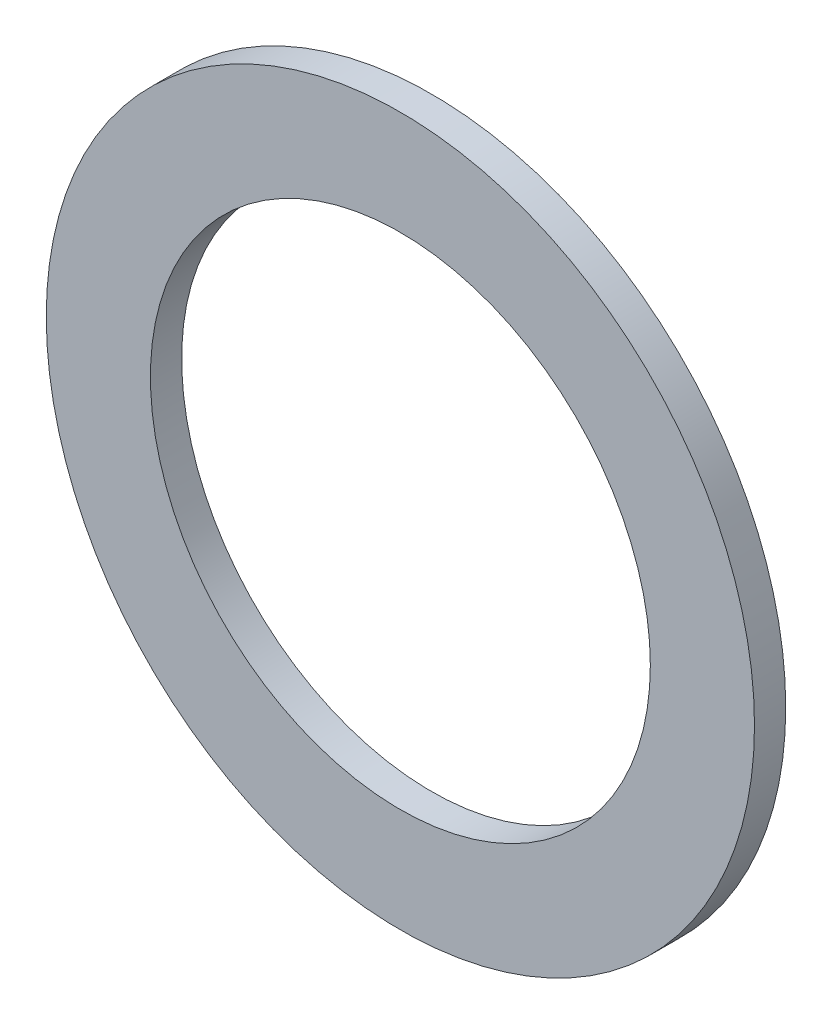
ISO-10303-21;
HEADER;
FILE_DESCRIPTION(('STEP AP214'),'2;1');
FILE_NAME('part.step','',(''),(''),'','','');
FILE_SCHEMA(('AUTOMOTIVE_DESIGN { 1 0 10303 214 1 1 1 1 }'));
ENDSEC;
DATA;
#1=APPLICATION_CONTEXT('core data for automotive mechanical design processes');
#2=APPLICATION_PROTOCOL_DEFINITION('international standard','automotive_design',2000,#1);
#3=PRODUCT_CONTEXT('',#1,'mechanical');
#4=PRODUCT('Part','Part','',(#3));
#5=PRODUCT_RELATED_PRODUCT_CATEGORY('part','',(#4));
#6=PRODUCT_DEFINITION_FORMATION('','',#4);
#7=PRODUCT_DEFINITION_CONTEXT('part definition',#1,'design');
#8=PRODUCT_DEFINITION('design','',#6,#7);
#9=PRODUCT_DEFINITION_SHAPE('','',#8);
#10=(LENGTH_UNIT() NAMED_UNIT(*) SI_UNIT(.MILLI.,.METRE.));
#11=(NAMED_UNIT(*) PLANE_ANGLE_UNIT() SI_UNIT($,.RADIAN.));
#12=(NAMED_UNIT(*) SI_UNIT($,.STERADIAN.) SOLID_ANGLE_UNIT());
#13=UNCERTAINTY_MEASURE_WITH_UNIT(LENGTH_MEASURE(1.E-05),#10,'distance_accuracy_value','');
#14=(GEOMETRIC_REPRESENTATION_CONTEXT(3) GLOBAL_UNCERTAINTY_ASSIGNED_CONTEXT((#13)) GLOBAL_UNIT_ASSIGNED_CONTEXT((#10,
#11,#12)) REPRESENTATION_CONTEXT('',''));
#15=CARTESIAN_POINT('',(0.,0.,0.));
#16=DIRECTION('',(0.,0.,1.));
#17=DIRECTION('',(1.,0.,0.));
#18=AXIS2_PLACEMENT_3D('',#15,#16,#17);
#19=CARTESIAN_POINT('',(0.,0.,1.5));
#20=DIRECTION('',(0.,0.,1.));
#21=DIRECTION('',(1.,0.,0.));
#22=AXIS2_PLACEMENT_3D('',#19,#20,#21);
#23=PLANE('',#22);
#24=CARTESIAN_POINT('',(0.,0.,1.5));
#25=DIRECTION('',(0.,0.,1.));
#26=DIRECTION('',(1.,0.,0.));
#27=AXIS2_PLACEMENT_3D('',#24,#25,#26);
#28=CIRCLE('',#27,17.);
#29=CARTESIAN_POINT('',(17.,0.,1.5));
#30=VERTEX_POINT('',#29);
#31=EDGE_CURVE('E11',#30,#30,#28,.T.);
#32=ORIENTED_EDGE('',*,*,#31,.T.);
#33=EDGE_LOOP('',(#32));
#34=FACE_BOUND('',#33,.T.);
#35=CARTESIAN_POINT('',(0.,0.,1.5));
#36=DIRECTION('',(0.,0.,1.));
#37=DIRECTION('',(1.,0.,0.));
#38=AXIS2_PLACEMENT_3D('',#35,#36,#37);
#39=CIRCLE('',#38,12.);
#40=CARTESIAN_POINT('',(12.,0.,1.5));
#41=VERTEX_POINT('',#40);
#42=EDGE_CURVE('E47',#41,#41,#39,.T.);
#43=ORIENTED_EDGE('',*,*,#42,.F.);
#44=EDGE_LOOP('',(#43));
#45=FACE_BOUND('',#44,.T.);
#46=ADVANCED_FACE('F36',(#34,#45),#23,.T.);
#47=CARTESIAN_POINT('',(0.,0.,0.));
#48=DIRECTION('',(0.,0.,1.));
#49=DIRECTION('',(1.,0.,0.));
#50=AXIS2_PLACEMENT_3D('',#47,#48,#49);
#51=PLANE('',#50);
#52=CARTESIAN_POINT('',(0.,0.,0.));
#53=DIRECTION('',(0.,0.,1.));
#54=DIRECTION('',(1.,0.,0.));
#55=AXIS2_PLACEMENT_3D('',#52,#53,#54);
#56=CIRCLE('',#55,17.);
#57=CARTESIAN_POINT('',(17.,0.,0.));
#58=VERTEX_POINT('',#57);
#59=EDGE_CURVE('E40',#58,#58,#56,.T.);
#60=ORIENTED_EDGE('',*,*,#59,.F.);
#61=EDGE_LOOP('',(#60));
#62=FACE_BOUND('',#61,.T.);
#63=CARTESIAN_POINT('',(0.,0.,0.));
#64=DIRECTION('',(0.,0.,1.));
#65=DIRECTION('',(1.,0.,0.));
#66=AXIS2_PLACEMENT_3D('',#63,#64,#65);
#67=CIRCLE('',#66,12.);
#68=CARTESIAN_POINT('',(12.,0.,0.));
#69=VERTEX_POINT('',#68);
#70=EDGE_CURVE('E49',#69,#69,#67,.T.);
#71=ORIENTED_EDGE('',*,*,#70,.T.);
#72=EDGE_LOOP('',(#71));
#73=FACE_BOUND('',#72,.T.);
#74=ADVANCED_FACE('F59',(#62,#73),#51,.F.);
#75=CARTESIAN_POINT('',(0.,0.,1.5));
#76=DIRECTION('',(0.,0.,-1.));
#77=DIRECTION('',(-1.,0.,0.));
#78=AXIS2_PLACEMENT_3D('',#75,#76,#77);
#79=CYLINDRICAL_SURFACE('',#78,17.);
#80=ORIENTED_EDGE('',*,*,#31,.F.);
#81=EDGE_LOOP('',(#80));
#82=FACE_BOUND('',#81,.T.);
#83=ORIENTED_EDGE('',*,*,#59,.T.);
#84=EDGE_LOOP('',(#83));
#85=FACE_BOUND('',#84,.T.);
#86=ADVANCED_FACE('F38',(#82,#85),#79,.T.);
#87=CARTESIAN_POINT('',(0.,0.,1.5));
#88=DIRECTION('',(0.,0.,-1.));
#89=DIRECTION('',(-1.,0.,0.));
#90=AXIS2_PLACEMENT_3D('',#87,#88,#89);
#91=CYLINDRICAL_SURFACE('',#90,12.);
#92=ORIENTED_EDGE('',*,*,#42,.T.);
#93=EDGE_LOOP('',(#92));
#94=FACE_BOUND('',#93,.T.);
#95=ORIENTED_EDGE('',*,*,#70,.F.);
#96=EDGE_LOOP('',(#95));
#97=FACE_BOUND('',#96,.T.);
#98=ADVANCED_FACE('F55',(#94,#97),#91,.F.);
#99=CLOSED_SHELL('',(#46,#74,#86,#98));
#100=MANIFOLD_SOLID_BREP('B2',#99);
#101=ADVANCED_BREP_SHAPE_REPRESENTATION('',(#18,#100),#14);
#102=SHAPE_DEFINITION_REPRESENTATION(#9,#101);
ENDSEC;
END-ISO-10303-21;
